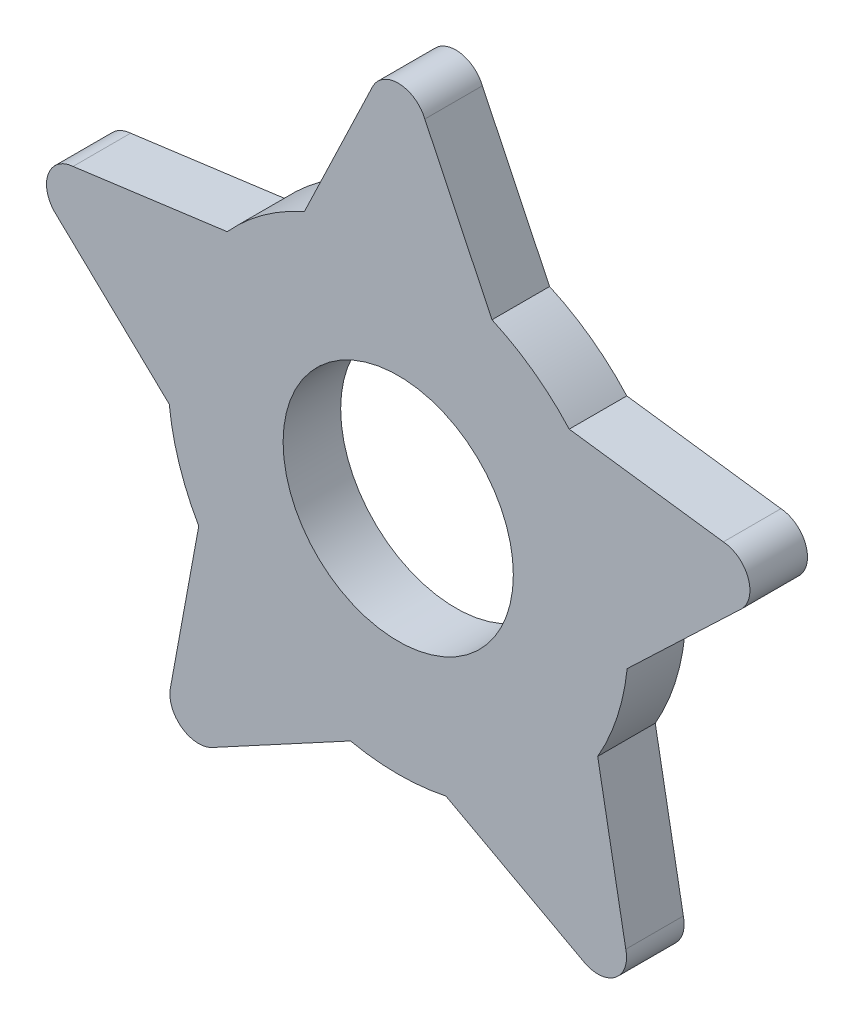
ISO-10303-21;
HEADER;
FILE_DESCRIPTION(('STEP AP214'),'2;1');
FILE_NAME('part.step','',(''),(''),'','','');
FILE_SCHEMA(('AUTOMOTIVE_DESIGN { 1 0 10303 214 1 1 1 1 }'));
ENDSEC;
DATA;
#1=APPLICATION_CONTEXT('core data for automotive mechanical design processes');
#2=APPLICATION_PROTOCOL_DEFINITION('international standard','automotive_design',2000,#1);
#3=PRODUCT_CONTEXT('',#1,'mechanical');
#4=PRODUCT('Part','Part','',(#3));
#5=PRODUCT_RELATED_PRODUCT_CATEGORY('part','',(#4));
#6=PRODUCT_DEFINITION_FORMATION('','',#4);
#7=PRODUCT_DEFINITION_CONTEXT('part definition',#1,'design');
#8=PRODUCT_DEFINITION('design','',#6,#7);
#9=PRODUCT_DEFINITION_SHAPE('','',#8);
#10=(LENGTH_UNIT() NAMED_UNIT(*) SI_UNIT(.MILLI.,.METRE.));
#11=(NAMED_UNIT(*) PLANE_ANGLE_UNIT() SI_UNIT($,.RADIAN.));
#12=(NAMED_UNIT(*) SI_UNIT($,.STERADIAN.) SOLID_ANGLE_UNIT());
#13=UNCERTAINTY_MEASURE_WITH_UNIT(LENGTH_MEASURE(1.E-05),#10,'distance_accuracy_value','');
#14=(GEOMETRIC_REPRESENTATION_CONTEXT(3) GLOBAL_UNCERTAINTY_ASSIGNED_CONTEXT((#13)) GLOBAL_UNIT_ASSIGNED_CONTEXT((#10,
#11,#12)) REPRESENTATION_CONTEXT('',''));
#15=CARTESIAN_POINT('',(0.,0.,0.));
#16=DIRECTION('',(0.,0.,1.));
#17=DIRECTION('',(1.,0.,0.));
#18=AXIS2_PLACEMENT_3D('',#15,#16,#17);
#19=CARTESIAN_POINT('',(0.,0.,1.05));
#20=DIRECTION('',(0.,0.,1.));
#21=DIRECTION('',(1.,0.,0.));
#22=AXIS2_PLACEMENT_3D('',#19,#20,#21);
#23=PLANE('',#22);
#24=CARTESIAN_POINT('',(0.,0.,1.05));
#25=DIRECTION('',(0.,0.,1.));
#26=DIRECTION('',(1.,0.,0.));
#27=AXIS2_PLACEMENT_3D('',#24,#25,#26);
#28=CIRCLE('',#27,4.4);
#29=CARTESIAN_POINT('',(-1.79220758056237,4.01845641859841,1.05));
#30=VERTEX_POINT('',#29);
#31=CARTESIAN_POINT('',(-3.26795656251473,2.94626202254941,1.05));
#32=VERTEX_POINT('',#31);
#33=EDGE_CURVE('E242',#30,#32,#28,.T.);
#34=ORIENTED_EDGE('',*,*,#33,.T.);
#35=DIRECTION('',(-0.991225120973966,-0.132184566232775,0.));
#36=VECTOR('',#35,1.);
#37=CARTESIAN_POINT('',(-6.21372794327376,2.55342945207949,1.05));
#38=LINE('',#37,#36);
#39=CARTESIAN_POINT('',(-6.21372794327376,2.5534294520795,1.05));
#40=VERTEX_POINT('',#39);
#41=EDGE_CURVE('E130',#32,#40,#38,.T.);
#42=ORIENTED_EDGE('',*,*,#41,.T.);
#43=CARTESIAN_POINT('',(-6.17103034871811,2.00508930634953,1.05));
#44=DIRECTION('',(0.,0.,1.));
#45=DIRECTION('',(1.,0.,0.));
#46=AXIS2_PLACEMENT_3D('',#43,#44,#45);
#47=CIRCLE('',#46,0.550000000000005);
#48=CARTESIAN_POINT('',(-6.52787967923254,1.58656982614411,1.05));
#49=VERTEX_POINT('',#48);
#50=EDGE_CURVE('E293',#40,#49,#47,.T.);
#51=ORIENTED_EDGE('',*,*,#50,.T.);
#52=DIRECTION('',(0.724221829507002,-0.689567068286712,0.));
#53=VECTOR('',#52,1.);
#54=CARTESIAN_POINT('',(-6.52787967923254,1.58656982614411,1.05));
#55=LINE('',#54,#53);
#56=CARTESIAN_POINT('',(-4.37560176219749,-0.46271937354543,1.05));
#57=VERTEX_POINT('',#56);
#58=EDGE_CURVE('E312',#49,#57,#55,.T.);
#59=ORIENTED_EDGE('',*,*,#58,.T.);
#60=CARTESIAN_POINT('',(0.,0.,1.05));
#61=DIRECTION('',(0.,0.,1.));
#62=DIRECTION('',(1.,0.,0.));
#63=AXIS2_PLACEMENT_3D('',#60,#61,#62);
#64=CIRCLE('',#63,4.4);
#65=CARTESIAN_POINT('',(-3.81191580995476,-2.19756634889983,1.05));
#66=VERTEX_POINT('',#65);
#67=EDGE_CURVE('E309',#57,#66,#64,.T.);
#68=ORIENTED_EDGE('',*,*,#67,.T.);
#69=DIRECTION('',(-0.180590414563001,-0.983558387777749,0.));
#70=VECTOR('',#69,1.);
#71=CARTESIAN_POINT('',(-4.34860325219431,-5.12055335630567,1.05));
#72=LINE('',#71,#70);
#73=CARTESIAN_POINT('',(-4.34860325219431,-5.12055335630567,1.05));
#74=VERTEX_POINT('',#73);
#75=EDGE_CURVE('E311',#66,#74,#72,.T.);
#76=ORIENTED_EDGE('',*,*,#75,.T.);
#77=CARTESIAN_POINT('',(-3.81390650111496,-5.24939195450199,1.05));
#78=DIRECTION('',(0.,0.,1.));
#79=DIRECTION('',(1.,0.,0.));
#80=AXIS2_PLACEMENT_3D('',#77,#78,#79);
#81=CIRCLE('',#80,0.550000000000005);
#82=CARTESIAN_POINT('',(-3.52614332982942,-5.71810546748375,1.05));
#83=VERTEX_POINT('',#82);
#84=EDGE_CURVE('E314',#74,#83,#81,.T.);
#85=ORIENTED_EDGE('',*,*,#84,.T.);
#86=DIRECTION('',(0.879614106731607,0.475687947333918,0.));
#87=VECTOR('',#86,1.);
#88=CARTESIAN_POINT('',(-3.52614332982942,-5.71810546748375,1.05));
#89=LINE('',#88,#87);
#90=CARTESIAN_POINT('',(-0.912063029709645,-4.30443271870253,1.05));
#91=VERTEX_POINT('',#90);
#92=EDGE_CURVE('E320',#83,#91,#89,.T.);
#93=ORIENTED_EDGE('',*,*,#92,.T.);
#94=CARTESIAN_POINT('',(0.,0.,1.05));
#95=DIRECTION('',(0.,0.,1.));
#96=DIRECTION('',(1.,0.,0.));
#97=AXIS2_PLACEMENT_3D('',#94,#95,#96);
#98=CIRCLE('',#97,4.4);
#99=CARTESIAN_POINT('',(0.912063029709576,-4.30443271870255,1.05));
#100=VERTEX_POINT('',#99);
#101=EDGE_CURVE('E322',#91,#100,#98,.T.);
#102=ORIENTED_EDGE('',*,*,#101,.T.);
#103=DIRECTION('',(0.8796141067316,-0.475687947333932,0.));
#104=VECTOR('',#103,1.);
#105=CARTESIAN_POINT('',(3.52614332982934,-5.71810546748381,1.05));
#106=LINE('',#105,#104);
#107=CARTESIAN_POINT('',(3.52614332982933,-5.71810546748381,1.05));
#108=VERTEX_POINT('',#107);
#109=EDGE_CURVE('E324',#100,#108,#106,.T.);
#110=ORIENTED_EDGE('',*,*,#109,.T.);
#111=CARTESIAN_POINT('',(3.81390650111487,-5.24939195450206,1.05));
#112=DIRECTION('',(0.,0.,1.));
#113=DIRECTION('',(1.,0.,0.));
#114=AXIS2_PLACEMENT_3D('',#111,#112,#113);
#115=CIRCLE('',#114,0.550000000000005);
#116=CARTESIAN_POINT('',(4.34860325219423,-5.12055335630574,1.05));
#117=VERTEX_POINT('',#116);
#118=EDGE_CURVE('E326',#108,#117,#115,.T.);
#119=ORIENTED_EDGE('',*,*,#118,.T.);
#120=DIRECTION('',(-0.180590414562986,0.983558387777751,0.));
#121=VECTOR('',#120,1.);
#122=CARTESIAN_POINT('',(4.34860325219423,-5.12055335630574,1.05));
#123=LINE('',#122,#121);
#124=CARTESIAN_POINT('',(3.81191580995473,-2.19756634889989,1.05));
#125=VERTEX_POINT('',#124);
#126=EDGE_CURVE('E328',#117,#125,#123,.T.);
#127=ORIENTED_EDGE('',*,*,#126,.T.);
#128=CARTESIAN_POINT('',(0.,0.,1.05));
#129=DIRECTION('',(0.,0.,1.));
#130=DIRECTION('',(1.,0.,0.));
#131=AXIS2_PLACEMENT_3D('',#128,#129,#130);
#132=CIRCLE('',#131,4.4);
#133=CARTESIAN_POINT('',(4.37560176219748,-0.462719373545438,1.05));
#134=VERTEX_POINT('',#133);
#135=EDGE_CURVE('E330',#125,#134,#132,.T.);
#136=ORIENTED_EDGE('',*,*,#135,.T.);
#137=DIRECTION('',(0.724221829507003,0.689567068286711,0.));
#138=VECTOR('',#137,1.);
#139=CARTESIAN_POINT('',(6.52787967923255,1.5865698261441,1.05));
#140=LINE('',#139,#138);
#141=CARTESIAN_POINT('',(6.52787967923255,1.58656982614409,1.05));
#142=VERTEX_POINT('',#141);
#143=EDGE_CURVE('E332',#134,#142,#140,.T.);
#144=ORIENTED_EDGE('',*,*,#143,.T.);
#145=CARTESIAN_POINT('',(6.17103034871812,2.00508930634951,1.05));
#146=DIRECTION('',(0.,0.,1.));
#147=DIRECTION('',(1.,0.,0.));
#148=AXIS2_PLACEMENT_3D('',#145,#146,#147);
#149=CIRCLE('',#148,0.550000000000006);
#150=CARTESIAN_POINT('',(6.21372794327376,2.55342945207949,1.05));
#151=VERTEX_POINT('',#150);
#152=EDGE_CURVE('E334',#142,#151,#149,.T.);
#153=ORIENTED_EDGE('',*,*,#152,.T.);
#154=DIRECTION('',(-0.991225120973966,0.132184566232776,0.));
#155=VECTOR('',#154,1.);
#156=CARTESIAN_POINT('',(6.21372794327376,2.55342945207949,1.05));
#157=LINE('',#156,#155);
#158=CARTESIAN_POINT('',(3.26795656251473,2.9462620225494,1.05));
#159=VERTEX_POINT('',#158);
#160=EDGE_CURVE('E336',#151,#159,#157,.T.);
#161=ORIENTED_EDGE('',*,*,#160,.T.);
#162=CARTESIAN_POINT('',(0.,0.,1.05));
#163=DIRECTION('',(0.,0.,1.));
#164=DIRECTION('',(1.,0.,0.));
#165=AXIS2_PLACEMENT_3D('',#162,#163,#164);
#166=CIRCLE('',#165,4.4);
#167=CARTESIAN_POINT('',(1.79220758056238,4.01845641859841,1.05));
#168=VERTEX_POINT('',#167);
#169=EDGE_CURVE('E185',#159,#168,#166,.T.);
#170=ORIENTED_EDGE('',*,*,#169,.T.);
#171=DIRECTION('',(-0.432020400701645,0.901863833057735,0.));
#172=VECTOR('',#171,1.);
#173=CARTESIAN_POINT('',(0.508308186406104,6.69865954556587,1.05));
#174=LINE('',#173,#172);
#175=CARTESIAN_POINT('',(0.508308186406111,6.69865954556587,1.05));
#176=VERTEX_POINT('',#175);
#177=EDGE_CURVE('E179',#168,#176,#174,.T.);
#178=ORIENTED_EDGE('',*,*,#177,.T.);
#179=CARTESIAN_POINT('',(0.,6.488605296305,1.05));
#180=DIRECTION('',(0.,0.,1.));
#181=DIRECTION('',(1.,0.,0.));
#182=AXIS2_PLACEMENT_3D('',#179,#180,#181);
#183=CIRCLE('',#182,0.550000000000005);
#184=CARTESIAN_POINT('',(-0.508308186406096,6.69865954556587,1.05));
#185=VERTEX_POINT('',#184);
#186=EDGE_CURVE('E183',#176,#185,#183,.T.);
#187=ORIENTED_EDGE('',*,*,#186,.T.);
#188=DIRECTION('',(-0.432020400701646,-0.901863833057735,0.));
#189=VECTOR('',#188,1.);
#190=CARTESIAN_POINT('',(-0.508308186406096,6.69865954556587,1.05));
#191=LINE('',#190,#189);
#192=EDGE_CURVE('E51',#185,#30,#191,.T.);
#193=ORIENTED_EDGE('',*,*,#192,.T.);
#194=EDGE_LOOP('',(#34,#42,#51,#59,#68,#76,#85,#93,#102,#110,#119,#127,#136,#144,#153,#161,#170,
#178,#187,#193));
#195=FACE_BOUND('',#194,.T.);
#196=CARTESIAN_POINT('',(0.,0.,1.05));
#197=DIRECTION('',(0.,0.,1.));
#198=DIRECTION('',(1.,0.,0.));
#199=AXIS2_PLACEMENT_3D('',#196,#197,#198);
#200=CIRCLE('',#199,2.2);
#201=CARTESIAN_POINT('',(2.2,0.,1.05));
#202=VERTEX_POINT('',#201);
#203=EDGE_CURVE('E207',#202,#202,#200,.T.);
#204=ORIENTED_EDGE('',*,*,#203,.F.);
#205=EDGE_LOOP('',(#204));
#206=FACE_BOUND('',#205,.T.);
#207=ADVANCED_FACE('F34',(#195,#206),#23,.T.);
#208=CARTESIAN_POINT('',(0.,0.,-0.05));
#209=DIRECTION('',(0.,0.,1.));
#210=DIRECTION('',(1.,0.,0.));
#211=AXIS2_PLACEMENT_3D('',#208,#209,#210);
#212=PLANE('',#211);
#213=CARTESIAN_POINT('',(0.,0.,-0.05));
#214=DIRECTION('',(0.,0.,1.));
#215=DIRECTION('',(1.,0.,0.));
#216=AXIS2_PLACEMENT_3D('',#213,#214,#215);
#217=CIRCLE('',#216,4.4);
#218=CARTESIAN_POINT('',(-1.79220758056237,4.01845641859841,-0.05));
#219=VERTEX_POINT('',#218);
#220=CARTESIAN_POINT('',(-3.26795656251473,2.94626202254941,-0.05));
#221=VERTEX_POINT('',#220);
#222=EDGE_CURVE('E203',#219,#221,#217,.T.);
#223=ORIENTED_EDGE('',*,*,#222,.F.);
#224=DIRECTION('',(-0.432020400701646,-0.901863833057735,0.));
#225=VECTOR('',#224,1.);
#226=CARTESIAN_POINT('',(-0.508308186406096,6.69865954556587,-0.05));
#227=LINE('',#226,#225);
#228=CARTESIAN_POINT('',(-0.508308186406096,6.69865954556587,-0.05));
#229=VERTEX_POINT('',#228);
#230=EDGE_CURVE('E122',#229,#219,#227,.T.);
#231=ORIENTED_EDGE('',*,*,#230,.F.);
#232=CARTESIAN_POINT('',(0.,6.488605296305,-0.05));
#233=DIRECTION('',(0.,0.,1.));
#234=DIRECTION('',(1.,0.,0.));
#235=AXIS2_PLACEMENT_3D('',#232,#233,#234);
#236=CIRCLE('',#235,0.550000000000005);
#237=CARTESIAN_POINT('',(0.508308186406111,6.69865954556587,-0.05));
#238=VERTEX_POINT('',#237);
#239=EDGE_CURVE('E116',#238,#229,#236,.T.);
#240=ORIENTED_EDGE('',*,*,#239,.F.);
#241=DIRECTION('',(-0.432020400701645,0.901863833057735,0.));
#242=VECTOR('',#241,1.);
#243=CARTESIAN_POINT('',(0.508308186406104,6.69865954556587,-0.05));
#244=LINE('',#243,#242);
#245=CARTESIAN_POINT('',(1.79220758056238,4.01845641859841,-0.05));
#246=VERTEX_POINT('',#245);
#247=EDGE_CURVE('E193',#246,#238,#244,.T.);
#248=ORIENTED_EDGE('',*,*,#247,.F.);
#249=CARTESIAN_POINT('',(0.,0.,-0.05));
#250=DIRECTION('',(0.,0.,1.));
#251=DIRECTION('',(1.,0.,0.));
#252=AXIS2_PLACEMENT_3D('',#249,#250,#251);
#253=CIRCLE('',#252,4.4);
#254=CARTESIAN_POINT('',(3.26795656251473,2.9462620225494,-0.05));
#255=VERTEX_POINT('',#254);
#256=EDGE_CURVE('E237',#255,#246,#253,.T.);
#257=ORIENTED_EDGE('',*,*,#256,.F.);
#258=DIRECTION('',(-0.991225120973966,0.132184566232776,0.));
#259=VECTOR('',#258,1.);
#260=CARTESIAN_POINT('',(6.21372794327376,2.55342945207949,-0.05));
#261=LINE('',#260,#259);
#262=CARTESIAN_POINT('',(6.21372794327376,2.55342945207949,-0.05));
#263=VERTEX_POINT('',#262);
#264=EDGE_CURVE('E235',#263,#255,#261,.T.);
#265=ORIENTED_EDGE('',*,*,#264,.F.);
#266=CARTESIAN_POINT('',(6.17103034871812,2.00508930634951,-0.05));
#267=DIRECTION('',(0.,0.,1.));
#268=DIRECTION('',(1.,0.,0.));
#269=AXIS2_PLACEMENT_3D('',#266,#267,#268);
#270=CIRCLE('',#269,0.550000000000006);
#271=CARTESIAN_POINT('',(6.52787967923255,1.58656982614409,-0.05));
#272=VERTEX_POINT('',#271);
#273=EDGE_CURVE('E233',#272,#263,#270,.T.);
#274=ORIENTED_EDGE('',*,*,#273,.F.);
#275=DIRECTION('',(0.724221829507003,0.689567068286711,0.));
#276=VECTOR('',#275,1.);
#277=CARTESIAN_POINT('',(6.52787967923255,1.5865698261441,-0.05));
#278=LINE('',#277,#276);
#279=CARTESIAN_POINT('',(4.37560176219748,-0.462719373545438,-0.05));
#280=VERTEX_POINT('',#279);
#281=EDGE_CURVE('E231',#280,#272,#278,.T.);
#282=ORIENTED_EDGE('',*,*,#281,.F.);
#283=CARTESIAN_POINT('',(0.,0.,-0.05));
#284=DIRECTION('',(0.,0.,1.));
#285=DIRECTION('',(1.,0.,0.));
#286=AXIS2_PLACEMENT_3D('',#283,#284,#285);
#287=CIRCLE('',#286,4.4);
#288=CARTESIAN_POINT('',(3.81191580995473,-2.19756634889989,-0.05));
#289=VERTEX_POINT('',#288);
#290=EDGE_CURVE('E229',#289,#280,#287,.T.);
#291=ORIENTED_EDGE('',*,*,#290,.F.);
#292=DIRECTION('',(-0.180590414562986,0.983558387777751,0.));
#293=VECTOR('',#292,1.);
#294=CARTESIAN_POINT('',(4.34860325219423,-5.12055335630574,-0.05));
#295=LINE('',#294,#293);
#296=CARTESIAN_POINT('',(4.34860325219423,-5.12055335630574,-0.05));
#297=VERTEX_POINT('',#296);
#298=EDGE_CURVE('E227',#297,#289,#295,.T.);
#299=ORIENTED_EDGE('',*,*,#298,.F.);
#300=CARTESIAN_POINT('',(3.81390650111487,-5.24939195450206,-0.05));
#301=DIRECTION('',(0.,0.,1.));
#302=DIRECTION('',(1.,0.,0.));
#303=AXIS2_PLACEMENT_3D('',#300,#301,#302);
#304=CIRCLE('',#303,0.550000000000005);
#305=CARTESIAN_POINT('',(3.52614332982933,-5.71810546748381,-0.05));
#306=VERTEX_POINT('',#305);
#307=EDGE_CURVE('E225',#306,#297,#304,.T.);
#308=ORIENTED_EDGE('',*,*,#307,.F.);
#309=DIRECTION('',(0.8796141067316,-0.475687947333932,0.));
#310=VECTOR('',#309,1.);
#311=CARTESIAN_POINT('',(3.52614332982934,-5.71810546748381,-0.05));
#312=LINE('',#311,#310);
#313=CARTESIAN_POINT('',(0.912063029709576,-4.30443271870255,-0.05));
#314=VERTEX_POINT('',#313);
#315=EDGE_CURVE('E223',#314,#306,#312,.T.);
#316=ORIENTED_EDGE('',*,*,#315,.F.);
#317=CARTESIAN_POINT('',(0.,0.,-0.05));
#318=DIRECTION('',(0.,0.,1.));
#319=DIRECTION('',(1.,0.,0.));
#320=AXIS2_PLACEMENT_3D('',#317,#318,#319);
#321=CIRCLE('',#320,4.4);
#322=CARTESIAN_POINT('',(-0.912063029709645,-4.30443271870253,-0.05));
#323=VERTEX_POINT('',#322);
#324=EDGE_CURVE('E221',#323,#314,#321,.T.);
#325=ORIENTED_EDGE('',*,*,#324,.F.);
#326=DIRECTION('',(0.879614106731607,0.475687947333918,0.));
#327=VECTOR('',#326,1.);
#328=CARTESIAN_POINT('',(-3.52614332982942,-5.71810546748375,-0.05));
#329=LINE('',#328,#327);
#330=CARTESIAN_POINT('',(-3.52614332982942,-5.71810546748375,-0.05));
#331=VERTEX_POINT('',#330);
#332=EDGE_CURVE('E219',#331,#323,#329,.T.);
#333=ORIENTED_EDGE('',*,*,#332,.F.);
#334=CARTESIAN_POINT('',(-3.81390650111496,-5.24939195450199,-0.05));
#335=DIRECTION('',(0.,0.,1.));
#336=DIRECTION('',(1.,0.,0.));
#337=AXIS2_PLACEMENT_3D('',#334,#335,#336);
#338=CIRCLE('',#337,0.550000000000005);
#339=CARTESIAN_POINT('',(-4.34860325219431,-5.12055335630567,-0.05));
#340=VERTEX_POINT('',#339);
#341=EDGE_CURVE('E217',#340,#331,#338,.T.);
#342=ORIENTED_EDGE('',*,*,#341,.F.);
#343=DIRECTION('',(-0.180590414563001,-0.983558387777749,0.));
#344=VECTOR('',#343,1.);
#345=CARTESIAN_POINT('',(-4.34860325219431,-5.12055335630567,-0.05));
#346=LINE('',#345,#344);
#347=CARTESIAN_POINT('',(-3.81191580995476,-2.19756634889983,-0.05));
#348=VERTEX_POINT('',#347);
#349=EDGE_CURVE('E215',#348,#340,#346,.T.);
#350=ORIENTED_EDGE('',*,*,#349,.F.);
#351=CARTESIAN_POINT('',(0.,0.,-0.05));
#352=DIRECTION('',(0.,0.,1.));
#353=DIRECTION('',(1.,0.,0.));
#354=AXIS2_PLACEMENT_3D('',#351,#352,#353);
#355=CIRCLE('',#354,4.4);
#356=CARTESIAN_POINT('',(-4.37560176219749,-0.46271937354543,-0.05));
#357=VERTEX_POINT('',#356);
#358=EDGE_CURVE('E213',#357,#348,#355,.T.);
#359=ORIENTED_EDGE('',*,*,#358,.F.);
#360=DIRECTION('',(0.724221829507002,-0.689567068286712,0.));
#361=VECTOR('',#360,1.);
#362=CARTESIAN_POINT('',(-6.52787967923254,1.58656982614411,-0.05));
#363=LINE('',#362,#361);
#364=CARTESIAN_POINT('',(-6.52787967923254,1.58656982614411,-0.05));
#365=VERTEX_POINT('',#364);
#366=EDGE_CURVE('E211',#365,#357,#363,.T.);
#367=ORIENTED_EDGE('',*,*,#366,.F.);
#368=CARTESIAN_POINT('',(-6.17103034871811,2.00508930634953,-0.05));
#369=DIRECTION('',(0.,0.,1.));
#370=DIRECTION('',(1.,0.,0.));
#371=AXIS2_PLACEMENT_3D('',#368,#369,#370);
#372=CIRCLE('',#371,0.550000000000005);
#373=CARTESIAN_POINT('',(-6.21372794327376,2.5534294520795,-0.05));
#374=VERTEX_POINT('',#373);
#375=EDGE_CURVE('E209',#374,#365,#372,.T.);
#376=ORIENTED_EDGE('',*,*,#375,.F.);
#377=DIRECTION('',(-0.991225120973966,-0.132184566232775,0.));
#378=VECTOR('',#377,1.);
#379=CARTESIAN_POINT('',(-6.21372794327376,2.55342945207949,-0.05));
#380=LINE('',#379,#378);
#381=EDGE_CURVE('E206',#221,#374,#380,.T.);
#382=ORIENTED_EDGE('',*,*,#381,.F.);
#383=EDGE_LOOP('',(#223,#231,#240,#248,#257,#265,#274,#282,#291,#299,#308,#316,#325,#333,#342,
#350,#359,#367,#376,#382));
#384=FACE_BOUND('',#383,.T.);
#385=CARTESIAN_POINT('',(0.,0.,-0.05));
#386=DIRECTION('',(0.,0.,1.));
#387=DIRECTION('',(1.,0.,0.));
#388=AXIS2_PLACEMENT_3D('',#385,#386,#387);
#389=CIRCLE('',#388,2.2);
#390=CARTESIAN_POINT('',(2.2,0.,-0.05));
#391=VERTEX_POINT('',#390);
#392=EDGE_CURVE('E587',#391,#391,#389,.T.);
#393=ORIENTED_EDGE('',*,*,#392,.T.);
#394=EDGE_LOOP('',(#393));
#395=FACE_BOUND('',#394,.T.);
#396=ADVANCED_FACE('F297',(#384,#395),#212,.F.);
#397=CARTESIAN_POINT('',(0.,0.,1.05));
#398=DIRECTION('',(0.,0.,-1.));
#399=DIRECTION('',(-1.,0.,0.));
#400=AXIS2_PLACEMENT_3D('',#397,#398,#399);
#401=CYLINDRICAL_SURFACE('',#400,4.4);
#402=ORIENTED_EDGE('',*,*,#222,.T.);
#403=DIRECTION('',(0.,0.,-1.));
#404=VECTOR('',#403,1.);
#405=CARTESIAN_POINT('',(-3.26795656251473,2.94626202254941,1.05));
#406=LINE('',#405,#404);
#407=EDGE_CURVE('E11',#32,#221,#406,.T.);
#408=ORIENTED_EDGE('',*,*,#407,.F.);
#409=ORIENTED_EDGE('',*,*,#33,.F.);
#410=DIRECTION('',(0.,0.,-1.));
#411=VECTOR('',#410,1.);
#412=CARTESIAN_POINT('',(-1.79220758056237,4.01845641859841,1.05));
#413=LINE('',#412,#411);
#414=EDGE_CURVE('E199',#30,#219,#413,.T.);
#415=ORIENTED_EDGE('',*,*,#414,.T.);
#416=EDGE_LOOP('',(#402,#408,#409,#415));
#417=FACE_BOUND('',#416,.T.);
#418=ADVANCED_FACE('F36',(#417),#401,.T.);
#419=CARTESIAN_POINT('',(-6.21372794327376,2.55342945207949,1.05));
#420=DIRECTION('',(0.132184566232775,-0.991225120973966,0.));
#421=DIRECTION('',(0.991225120973966,0.132184566232775,0.));
#422=AXIS2_PLACEMENT_3D('',#419,#420,#421);
#423=PLANE('',#422);
#424=ORIENTED_EDGE('',*,*,#381,.T.);
#425=DIRECTION('',(0.,0.,-1.));
#426=VECTOR('',#425,1.);
#427=CARTESIAN_POINT('',(-6.21372794327376,2.5534294520795,1.05));
#428=LINE('',#427,#426);
#429=EDGE_CURVE('E43',#40,#374,#428,.T.);
#430=ORIENTED_EDGE('',*,*,#429,.F.);
#431=ORIENTED_EDGE('',*,*,#41,.F.);
#432=ORIENTED_EDGE('',*,*,#407,.T.);
#433=EDGE_LOOP('',(#424,#430,#431,#432));
#434=FACE_BOUND('',#433,.T.);
#435=ADVANCED_FACE('F370',(#434),#423,.F.);
#436=CARTESIAN_POINT('',(-6.17103034871811,2.00508930634953,1.05));
#437=DIRECTION('',(0.,0.,-1.));
#438=DIRECTION('',(-1.,0.,0.));
#439=AXIS2_PLACEMENT_3D('',#436,#437,#438);
#440=CYLINDRICAL_SURFACE('',#439,0.550000000000005);
#441=ORIENTED_EDGE('',*,*,#375,.T.);
#442=DIRECTION('',(0.,0.,-1.));
#443=VECTOR('',#442,1.);
#444=CARTESIAN_POINT('',(-6.52787967923254,1.58656982614411,1.05));
#445=LINE('',#444,#443);
#446=EDGE_CURVE('E285',#49,#365,#445,.T.);
#447=ORIENTED_EDGE('',*,*,#446,.F.);
#448=ORIENTED_EDGE('',*,*,#50,.F.);
#449=ORIENTED_EDGE('',*,*,#429,.T.);
#450=EDGE_LOOP('',(#441,#447,#448,#449));
#451=FACE_BOUND('',#450,.T.);
#452=ADVANCED_FACE('F291',(#451),#440,.T.);
#453=CARTESIAN_POINT('',(-6.52787967923254,1.58656982614411,1.05));
#454=DIRECTION('',(0.689567068286712,0.724221829507002,0.));
#455=DIRECTION('',(-0.724221829507002,0.689567068286712,0.));
#456=AXIS2_PLACEMENT_3D('',#453,#454,#455);
#457=PLANE('',#456);
#458=ORIENTED_EDGE('',*,*,#366,.T.);
#459=DIRECTION('',(0.,0.,-1.));
#460=VECTOR('',#459,1.);
#461=CARTESIAN_POINT('',(-4.37560176219749,-0.46271937354543,1.05));
#462=LINE('',#461,#460);
#463=EDGE_CURVE('E282',#57,#357,#462,.T.);
#464=ORIENTED_EDGE('',*,*,#463,.F.);
#465=ORIENTED_EDGE('',*,*,#58,.F.);
#466=ORIENTED_EDGE('',*,*,#446,.T.);
#467=EDGE_LOOP('',(#458,#464,#465,#466));
#468=FACE_BOUND('',#467,.T.);
#469=ADVANCED_FACE('F303',(#468),#457,.F.);
#470=CARTESIAN_POINT('',(0.,0.,1.05));
#471=DIRECTION('',(0.,0.,-1.));
#472=DIRECTION('',(-1.,0.,0.));
#473=AXIS2_PLACEMENT_3D('',#470,#471,#472);
#474=CYLINDRICAL_SURFACE('',#473,4.4);
#475=ORIENTED_EDGE('',*,*,#358,.T.);
#476=DIRECTION('',(0.,0.,-1.));
#477=VECTOR('',#476,1.);
#478=CARTESIAN_POINT('',(-3.81191580995476,-2.19756634889983,1.05));
#479=LINE('',#478,#477);
#480=EDGE_CURVE('E279',#66,#348,#479,.T.);
#481=ORIENTED_EDGE('',*,*,#480,.F.);
#482=ORIENTED_EDGE('',*,*,#67,.F.);
#483=ORIENTED_EDGE('',*,*,#463,.T.);
#484=EDGE_LOOP('',(#475,#481,#482,#483));
#485=FACE_BOUND('',#484,.T.);
#486=ADVANCED_FACE('F307',(#485),#474,.T.);
#487=CARTESIAN_POINT('',(-4.34860325219431,-5.12055335630567,1.05));
#488=DIRECTION('',(0.983558387777748,-0.180590414563001,0.));
#489=DIRECTION('',(0.180590414563001,0.983558387777749,0.));
#490=AXIS2_PLACEMENT_3D('',#487,#488,#489);
#491=PLANE('',#490);
#492=ORIENTED_EDGE('',*,*,#349,.T.);
#493=DIRECTION('',(0.,0.,-1.));
#494=VECTOR('',#493,1.);
#495=CARTESIAN_POINT('',(-4.34860325219431,-5.12055335630567,1.05));
#496=LINE('',#495,#494);
#497=EDGE_CURVE('E276',#74,#340,#496,.T.);
#498=ORIENTED_EDGE('',*,*,#497,.F.);
#499=ORIENTED_EDGE('',*,*,#75,.F.);
#500=ORIENTED_EDGE('',*,*,#480,.T.);
#501=EDGE_LOOP('',(#492,#498,#499,#500));
#502=FACE_BOUND('',#501,.T.);
#503=ADVANCED_FACE('F383',(#502),#491,.F.);
#504=CARTESIAN_POINT('',(-3.81390650111496,-5.24939195450199,1.05));
#505=DIRECTION('',(0.,0.,-1.));
#506=DIRECTION('',(-1.,0.,0.));
#507=AXIS2_PLACEMENT_3D('',#504,#505,#506);
#508=CYLINDRICAL_SURFACE('',#507,0.550000000000005);
#509=ORIENTED_EDGE('',*,*,#341,.T.);
#510=DIRECTION('',(0.,0.,-1.));
#511=VECTOR('',#510,1.);
#512=CARTESIAN_POINT('',(-3.52614332982942,-5.71810546748375,1.05));
#513=LINE('',#512,#511);
#514=EDGE_CURVE('E273',#83,#331,#513,.T.);
#515=ORIENTED_EDGE('',*,*,#514,.F.);
#516=ORIENTED_EDGE('',*,*,#84,.F.);
#517=ORIENTED_EDGE('',*,*,#497,.T.);
#518=EDGE_LOOP('',(#509,#515,#516,#517));
#519=FACE_BOUND('',#518,.T.);
#520=ADVANCED_FACE('F386',(#519),#508,.T.);
#521=CARTESIAN_POINT('',(-3.52614332982942,-5.71810546748375,1.05));
#522=DIRECTION('',(-0.475687947333918,0.879614106731608,0.));
#523=DIRECTION('',(-0.879614106731608,-0.475687947333918,0.));
#524=AXIS2_PLACEMENT_3D('',#521,#522,#523);
#525=PLANE('',#524);
#526=ORIENTED_EDGE('',*,*,#332,.T.);
#527=DIRECTION('',(0.,0.,-1.));
#528=VECTOR('',#527,1.);
#529=CARTESIAN_POINT('',(-0.912063029709645,-4.30443271870253,1.05));
#530=LINE('',#529,#528);
#531=EDGE_CURVE('E270',#91,#323,#530,.T.);
#532=ORIENTED_EDGE('',*,*,#531,.F.);
#533=ORIENTED_EDGE('',*,*,#92,.F.);
#534=ORIENTED_EDGE('',*,*,#514,.T.);
#535=EDGE_LOOP('',(#526,#532,#533,#534));
#536=FACE_BOUND('',#535,.T.);
#537=ADVANCED_FACE('F390',(#536),#525,.F.);
#538=CARTESIAN_POINT('',(0.,0.,1.05));
#539=DIRECTION('',(0.,0.,-1.));
#540=DIRECTION('',(-1.,0.,0.));
#541=AXIS2_PLACEMENT_3D('',#538,#539,#540);
#542=CYLINDRICAL_SURFACE('',#541,4.4);
#543=ORIENTED_EDGE('',*,*,#324,.T.);
#544=DIRECTION('',(0.,0.,-1.));
#545=VECTOR('',#544,1.);
#546=CARTESIAN_POINT('',(0.912063029709576,-4.30443271870255,1.05));
#547=LINE('',#546,#545);
#548=EDGE_CURVE('E267',#100,#314,#547,.T.);
#549=ORIENTED_EDGE('',*,*,#548,.F.);
#550=ORIENTED_EDGE('',*,*,#101,.F.);
#551=ORIENTED_EDGE('',*,*,#531,.T.);
#552=EDGE_LOOP('',(#543,#549,#550,#551));
#553=FACE_BOUND('',#552,.T.);
#554=ADVANCED_FACE('F394',(#553),#542,.T.);
#555=CARTESIAN_POINT('',(3.52614332982934,-5.71810546748381,1.05));
#556=DIRECTION('',(0.475687947333932,0.8796141067316,0.));
#557=DIRECTION('',(-0.8796141067316,0.475687947333932,0.));
#558=AXIS2_PLACEMENT_3D('',#555,#556,#557);
#559=PLANE('',#558);
#560=ORIENTED_EDGE('',*,*,#315,.T.);
#561=DIRECTION('',(0.,0.,-1.));
#562=VECTOR('',#561,1.);
#563=CARTESIAN_POINT('',(3.52614332982933,-5.71810546748381,1.05));
#564=LINE('',#563,#562);
#565=EDGE_CURVE('E264',#108,#306,#564,.T.);
#566=ORIENTED_EDGE('',*,*,#565,.F.);
#567=ORIENTED_EDGE('',*,*,#109,.F.);
#568=ORIENTED_EDGE('',*,*,#548,.T.);
#569=EDGE_LOOP('',(#560,#566,#567,#568));
#570=FACE_BOUND('',#569,.T.);
#571=ADVANCED_FACE('F398',(#570),#559,.F.);
#572=CARTESIAN_POINT('',(3.81390650111487,-5.24939195450206,1.05));
#573=DIRECTION('',(0.,0.,-1.));
#574=DIRECTION('',(-1.,0.,0.));
#575=AXIS2_PLACEMENT_3D('',#572,#573,#574);
#576=CYLINDRICAL_SURFACE('',#575,0.550000000000005);
#577=ORIENTED_EDGE('',*,*,#307,.T.);
#578=DIRECTION('',(0.,0.,-1.));
#579=VECTOR('',#578,1.);
#580=CARTESIAN_POINT('',(4.34860325219423,-5.12055335630574,1.05));
#581=LINE('',#580,#579);
#582=EDGE_CURVE('E261',#117,#297,#581,.T.);
#583=ORIENTED_EDGE('',*,*,#582,.F.);
#584=ORIENTED_EDGE('',*,*,#118,.F.);
#585=ORIENTED_EDGE('',*,*,#565,.T.);
#586=EDGE_LOOP('',(#577,#583,#584,#585));
#587=FACE_BOUND('',#586,.T.);
#588=ADVANCED_FACE('F402',(#587),#576,.T.);
#589=CARTESIAN_POINT('',(4.34860325219423,-5.12055335630574,1.05));
#590=DIRECTION('',(-0.983558387777751,-0.180590414562986,0.));
#591=DIRECTION('',(0.180590414562986,-0.983558387777751,0.));
#592=AXIS2_PLACEMENT_3D('',#589,#590,#591);
#593=PLANE('',#592);
#594=ORIENTED_EDGE('',*,*,#298,.T.);
#595=DIRECTION('',(0.,0.,-1.));
#596=VECTOR('',#595,1.);
#597=CARTESIAN_POINT('',(3.81191580995473,-2.19756634889989,1.05));
#598=LINE('',#597,#596);
#599=EDGE_CURVE('E258',#125,#289,#598,.T.);
#600=ORIENTED_EDGE('',*,*,#599,.F.);
#601=ORIENTED_EDGE('',*,*,#126,.F.);
#602=ORIENTED_EDGE('',*,*,#582,.T.);
#603=EDGE_LOOP('',(#594,#600,#601,#602));
#604=FACE_BOUND('',#603,.T.);
#605=ADVANCED_FACE('F406',(#604),#593,.F.);
#606=CARTESIAN_POINT('',(0.,0.,1.05));
#607=DIRECTION('',(0.,0.,-1.));
#608=DIRECTION('',(-1.,0.,0.));
#609=AXIS2_PLACEMENT_3D('',#606,#607,#608);
#610=CYLINDRICAL_SURFACE('',#609,4.4);
#611=ORIENTED_EDGE('',*,*,#290,.T.);
#612=DIRECTION('',(0.,0.,-1.));
#613=VECTOR('',#612,1.);
#614=CARTESIAN_POINT('',(4.37560176219748,-0.462719373545438,1.05));
#615=LINE('',#614,#613);
#616=EDGE_CURVE('E255',#134,#280,#615,.T.);
#617=ORIENTED_EDGE('',*,*,#616,.F.);
#618=ORIENTED_EDGE('',*,*,#135,.F.);
#619=ORIENTED_EDGE('',*,*,#599,.T.);
#620=EDGE_LOOP('',(#611,#617,#618,#619));
#621=FACE_BOUND('',#620,.T.);
#622=ADVANCED_FACE('F410',(#621),#610,.T.);
#623=CARTESIAN_POINT('',(6.52787967923255,1.5865698261441,1.05));
#624=DIRECTION('',(-0.689567068286711,0.724221829507003,0.));
#625=DIRECTION('',(-0.724221829507003,-0.689567068286711,0.));
#626=AXIS2_PLACEMENT_3D('',#623,#624,#625);
#627=PLANE('',#626);
#628=ORIENTED_EDGE('',*,*,#281,.T.);
#629=DIRECTION('',(0.,0.,-1.));
#630=VECTOR('',#629,1.);
#631=CARTESIAN_POINT('',(6.52787967923255,1.58656982614409,1.05));
#632=LINE('',#631,#630);
#633=EDGE_CURVE('E252',#142,#272,#632,.T.);
#634=ORIENTED_EDGE('',*,*,#633,.F.);
#635=ORIENTED_EDGE('',*,*,#143,.F.);
#636=ORIENTED_EDGE('',*,*,#616,.T.);
#637=EDGE_LOOP('',(#628,#634,#635,#636));
#638=FACE_BOUND('',#637,.T.);
#639=ADVANCED_FACE('F414',(#638),#627,.F.);
#640=CARTESIAN_POINT('',(6.17103034871812,2.00508930634951,1.05));
#641=DIRECTION('',(0.,0.,-1.));
#642=DIRECTION('',(-1.,0.,0.));
#643=AXIS2_PLACEMENT_3D('',#640,#641,#642);
#644=CYLINDRICAL_SURFACE('',#643,0.550000000000006);
#645=ORIENTED_EDGE('',*,*,#273,.T.);
#646=DIRECTION('',(0.,0.,-1.));
#647=VECTOR('',#646,1.);
#648=CARTESIAN_POINT('',(6.21372794327376,2.55342945207949,1.05));
#649=LINE('',#648,#647);
#650=EDGE_CURVE('E249',#151,#263,#649,.T.);
#651=ORIENTED_EDGE('',*,*,#650,.F.);
#652=ORIENTED_EDGE('',*,*,#152,.F.);
#653=ORIENTED_EDGE('',*,*,#633,.T.);
#654=EDGE_LOOP('',(#645,#651,#652,#653));
#655=FACE_BOUND('',#654,.T.);
#656=ADVANCED_FACE('F418',(#655),#644,.T.);
#657=CARTESIAN_POINT('',(6.21372794327376,2.55342945207949,1.05));
#658=DIRECTION('',(-0.132184566232776,-0.991225120973966,0.));
#659=DIRECTION('',(0.991225120973966,-0.132184566232776,0.));
#660=AXIS2_PLACEMENT_3D('',#657,#658,#659);
#661=PLANE('',#660);
#662=ORIENTED_EDGE('',*,*,#264,.T.);
#663=DIRECTION('',(0.,0.,-1.));
#664=VECTOR('',#663,1.);
#665=CARTESIAN_POINT('',(3.26795656251473,2.9462620225494,1.05));
#666=LINE('',#665,#664);
#667=EDGE_CURVE('E246',#159,#255,#666,.T.);
#668=ORIENTED_EDGE('',*,*,#667,.F.);
#669=ORIENTED_EDGE('',*,*,#160,.F.);
#670=ORIENTED_EDGE('',*,*,#650,.T.);
#671=EDGE_LOOP('',(#662,#668,#669,#670));
#672=FACE_BOUND('',#671,.T.);
#673=ADVANCED_FACE('F342',(#672),#661,.F.);
#674=CARTESIAN_POINT('',(0.,0.,1.05));
#675=DIRECTION('',(0.,0.,-1.));
#676=DIRECTION('',(-1.,0.,0.));
#677=AXIS2_PLACEMENT_3D('',#674,#675,#676);
#678=CYLINDRICAL_SURFACE('',#677,4.4);
#679=ORIENTED_EDGE('',*,*,#256,.T.);
#680=DIRECTION('',(0.,0.,-1.));
#681=VECTOR('',#680,1.);
#682=CARTESIAN_POINT('',(1.79220758056238,4.01845641859841,1.05));
#683=LINE('',#682,#681);
#684=EDGE_CURVE('E194',#168,#246,#683,.T.);
#685=ORIENTED_EDGE('',*,*,#684,.F.);
#686=ORIENTED_EDGE('',*,*,#169,.F.);
#687=ORIENTED_EDGE('',*,*,#667,.T.);
#688=EDGE_LOOP('',(#679,#685,#686,#687));
#689=FACE_BOUND('',#688,.T.);
#690=ADVANCED_FACE('F346',(#689),#678,.T.);
#691=CARTESIAN_POINT('',(0.508308186406104,6.69865954556587,1.05));
#692=DIRECTION('',(-0.901863833057735,-0.432020400701645,0.));
#693=DIRECTION('',(0.432020400701645,-0.901863833057735,0.));
#694=AXIS2_PLACEMENT_3D('',#691,#692,#693);
#695=PLANE('',#694);
#696=ORIENTED_EDGE('',*,*,#247,.T.);
#697=DIRECTION('',(0.,0.,-1.));
#698=VECTOR('',#697,1.);
#699=CARTESIAN_POINT('',(0.508308186406111,6.69865954556587,1.05));
#700=LINE('',#699,#698);
#701=EDGE_CURVE('E190',#176,#238,#700,.T.);
#702=ORIENTED_EDGE('',*,*,#701,.F.);
#703=ORIENTED_EDGE('',*,*,#177,.F.);
#704=ORIENTED_EDGE('',*,*,#684,.T.);
#705=EDGE_LOOP('',(#696,#702,#703,#704));
#706=FACE_BOUND('',#705,.T.);
#707=ADVANCED_FACE('F191',(#706),#695,.F.);
#708=CARTESIAN_POINT('',(0.,6.488605296305,1.05));
#709=DIRECTION('',(0.,0.,-1.));
#710=DIRECTION('',(-1.,0.,0.));
#711=AXIS2_PLACEMENT_3D('',#708,#709,#710);
#712=CYLINDRICAL_SURFACE('',#711,0.550000000000005);
#713=ORIENTED_EDGE('',*,*,#239,.T.);
#714=DIRECTION('',(0.,0.,-1.));
#715=VECTOR('',#714,1.);
#716=CARTESIAN_POINT('',(-0.508308186406096,6.69865954556587,1.05));
#717=LINE('',#716,#715);
#718=EDGE_CURVE('E195',#185,#229,#717,.T.);
#719=ORIENTED_EDGE('',*,*,#718,.F.);
#720=ORIENTED_EDGE('',*,*,#186,.F.);
#721=ORIENTED_EDGE('',*,*,#701,.T.);
#722=EDGE_LOOP('',(#713,#719,#720,#721));
#723=FACE_BOUND('',#722,.T.);
#724=ADVANCED_FACE('F197',(#723),#712,.T.);
#725=CARTESIAN_POINT('',(-0.508308186406096,6.69865954556587,1.05));
#726=DIRECTION('',(0.901863833057735,-0.432020400701646,0.));
#727=DIRECTION('',(0.432020400701646,0.901863833057735,0.));
#728=AXIS2_PLACEMENT_3D('',#725,#726,#727);
#729=PLANE('',#728);
#730=ORIENTED_EDGE('',*,*,#230,.T.);
#731=ORIENTED_EDGE('',*,*,#414,.F.);
#732=ORIENTED_EDGE('',*,*,#192,.F.);
#733=ORIENTED_EDGE('',*,*,#718,.T.);
#734=EDGE_LOOP('',(#730,#731,#732,#733));
#735=FACE_BOUND('',#734,.T.);
#736=ADVANCED_FACE('F350',(#735),#729,.F.);
#737=CARTESIAN_POINT('',(0.,0.,1.05));
#738=DIRECTION('',(0.,0.,-1.));
#739=DIRECTION('',(-1.,0.,0.));
#740=AXIS2_PLACEMENT_3D('',#737,#738,#739);
#741=CYLINDRICAL_SURFACE('',#740,2.2);
#742=ORIENTED_EDGE('',*,*,#203,.T.);
#743=EDGE_LOOP('',(#742));
#744=FACE_BOUND('',#743,.T.);
#745=ORIENTED_EDGE('',*,*,#392,.F.);
#746=EDGE_LOOP('',(#745));
#747=FACE_BOUND('',#746,.T.);
#748=ADVANCED_FACE('F352',(#744,#747),#741,.F.);
#749=CLOSED_SHELL('',(#207,#396,#418,#435,#452,#469,#486,#503,#520,#537,#554,#571,#588,#605,
#622,#639,#656,#673,#690,#707,#724,#736,#748));
#750=MANIFOLD_SOLID_BREP('B2',#749);
#751=ADVANCED_BREP_SHAPE_REPRESENTATION('',(#18,#750),#14);
#752=SHAPE_DEFINITION_REPRESENTATION(#9,#751);
ENDSEC;
END-ISO-10303-21;
